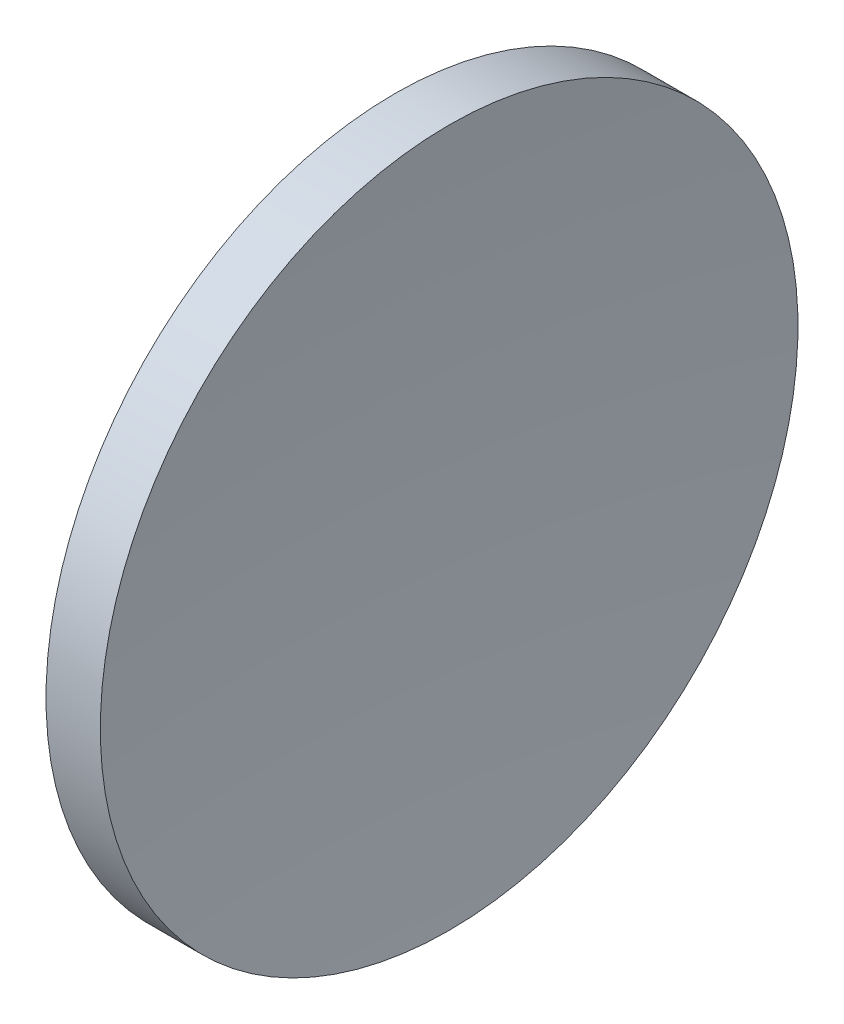
ISO-10303-21;
HEADER;
FILE_DESCRIPTION(('STEP AP214'),'2;1');
FILE_NAME('part.step','',(''),(''),'','','');
FILE_SCHEMA(('AUTOMOTIVE_DESIGN { 1 0 10303 214 1 1 1 1 }'));
ENDSEC;
DATA;
#1=APPLICATION_CONTEXT('core data for automotive mechanical design processes');
#2=APPLICATION_PROTOCOL_DEFINITION('international standard','automotive_design',2000,#1);
#3=PRODUCT_CONTEXT('',#1,'mechanical');
#4=PRODUCT('Part','Part','',(#3));
#5=PRODUCT_RELATED_PRODUCT_CATEGORY('part','',(#4));
#6=PRODUCT_DEFINITION_FORMATION('','',#4);
#7=PRODUCT_DEFINITION_CONTEXT('part definition',#1,'design');
#8=PRODUCT_DEFINITION('design','',#6,#7);
#9=PRODUCT_DEFINITION_SHAPE('','',#8);
#10=(LENGTH_UNIT() NAMED_UNIT(*) SI_UNIT(.MILLI.,.METRE.));
#11=(NAMED_UNIT(*) PLANE_ANGLE_UNIT() SI_UNIT($,.RADIAN.));
#12=(NAMED_UNIT(*) SI_UNIT($,.STERADIAN.) SOLID_ANGLE_UNIT());
#13=UNCERTAINTY_MEASURE_WITH_UNIT(LENGTH_MEASURE(1.E-05),#10,'distance_accuracy_value','');
#14=(GEOMETRIC_REPRESENTATION_CONTEXT(3) GLOBAL_UNCERTAINTY_ASSIGNED_CONTEXT((#13)) GLOBAL_UNIT_ASSIGNED_CONTEXT((#10,
#11,#12)) REPRESENTATION_CONTEXT('',''));
#15=CARTESIAN_POINT('',(0.,0.,0.));
#16=DIRECTION('',(0.,0.,1.));
#17=DIRECTION('',(1.,0.,0.));
#18=AXIS2_PLACEMENT_3D('',#15,#16,#17);
#19=CARTESIAN_POINT('',(189.855421315556,65.2168404709403,0.));
#20=DIRECTION('',(-1.,0.,0.));
#21=DIRECTION('',(0.,1.,0.));
#22=AXIS2_PLACEMENT_3D('',#19,#20,#21);
#23=SPHERICAL_SURFACE('',#22,67.);
#24=CARTESIAN_POINT('',(125.613306040605,65.2168404709403,0.));
#25=DIRECTION('',(-1.,0.,0.));
#26=DIRECTION('',(0.,-1.,0.));
#27=AXIS2_PLACEMENT_3D('',#24,#25,#26);
#28=CIRCLE('',#27,19.025);
#29=CARTESIAN_POINT('',(125.613306040605,46.1918404709403,0.));
#30=VERTEX_POINT('',#29);
#31=EDGE_CURVE('E41',#30,#30,#28,.T.);
#32=ORIENTED_EDGE('',*,*,#31,.T.);
#33=EDGE_LOOP('',(#32));
#34=FACE_BOUND('',#33,.T.);
#35=ADVANCED_FACE('F35',(#34),#23,.T.);
#36=CARTESIAN_POINT('',(305.555421315556,65.2168404709403,0.));
#37=DIRECTION('',(-1.,0.,0.));
#38=DIRECTION('',(0.,1.,0.));
#39=AXIS2_PLACEMENT_3D('',#36,#37,#38);
#40=SPHERICAL_SURFACE('',#39,178.);
#41=CARTESIAN_POINT('',(128.5750569386,65.2168404709403,0.));
#42=DIRECTION('',(-1.,0.,0.));
#43=DIRECTION('',(0.,-1.,0.));
#44=AXIS2_PLACEMENT_3D('',#41,#42,#43);
#45=CIRCLE('',#44,19.025);
#46=CARTESIAN_POINT('',(128.5750569386,46.1918404709404,0.));
#47=VERTEX_POINT('',#46);
#48=EDGE_CURVE('E10',#47,#47,#45,.T.);
#49=ORIENTED_EDGE('',*,*,#48,.F.);
#50=EDGE_LOOP('',(#49));
#51=FACE_BOUND('',#50,.T.);
#52=ADVANCED_FACE('F50',(#51),#40,.F.);
#53=CARTESIAN_POINT('',(115.944491297963,65.2168404709403,0.));
#54=DIRECTION('',(-1.,0.,0.));
#55=DIRECTION('',(0.,-1.,0.));
#56=AXIS2_PLACEMENT_3D('',#53,#54,#55);
#57=CYLINDRICAL_SURFACE('',#56,19.025);
#58=ORIENTED_EDGE('',*,*,#31,.F.);
#59=EDGE_LOOP('',(#58));
#60=FACE_BOUND('',#59,.T.);
#61=ORIENTED_EDGE('',*,*,#48,.T.);
#62=EDGE_LOOP('',(#61));
#63=FACE_BOUND('',#62,.T.);
#64=ADVANCED_FACE('F48',(#60,#63),#57,.T.);
#65=CLOSED_SHELL('',(#35,#52,#64));
#66=MANIFOLD_SOLID_BREP('B2',#65);
#67=ADVANCED_BREP_SHAPE_REPRESENTATION('',(#18,#66),#14);
#68=SHAPE_DEFINITION_REPRESENTATION(#9,#67);
ENDSEC;
END-ISO-10303-21;
